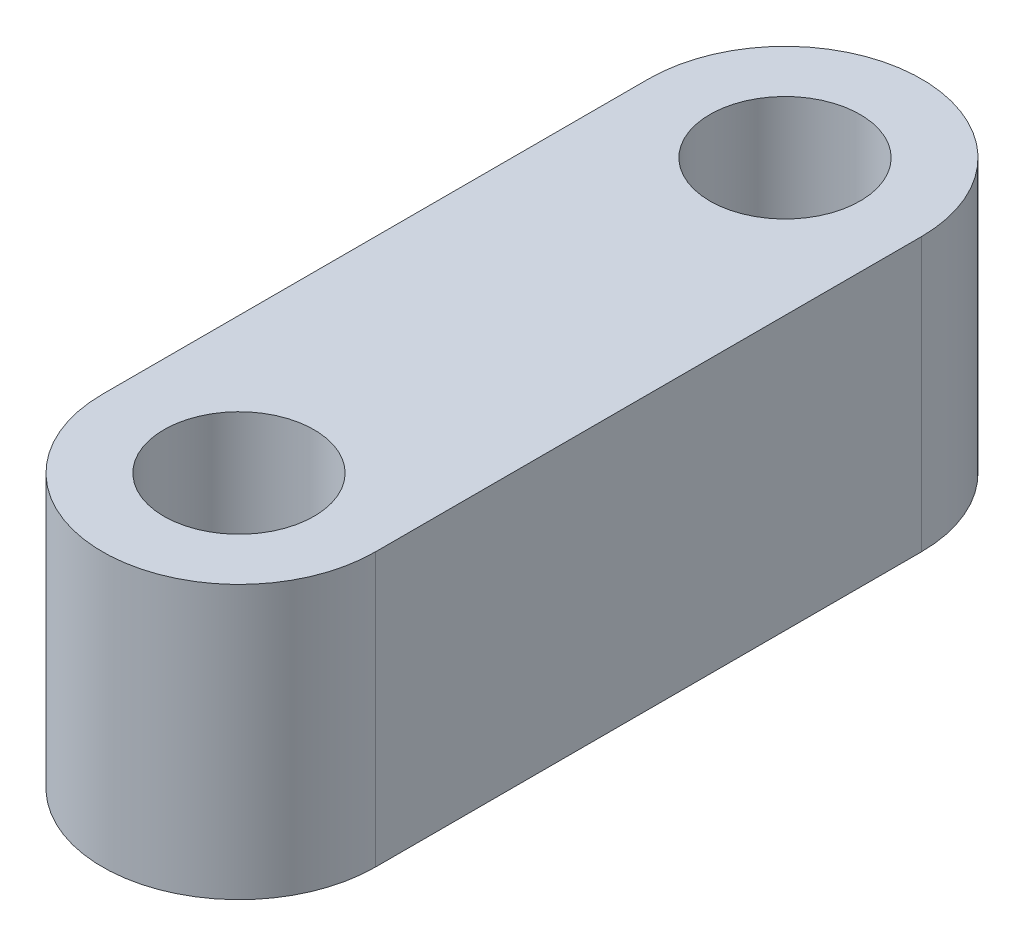
ISO-10303-21;
HEADER;
FILE_DESCRIPTION(('STEP AP214'),'2;1');
FILE_NAME('part.step','',(''),(''),'','','');
FILE_SCHEMA(('AUTOMOTIVE_DESIGN { 1 0 10303 214 1 1 1 1 }'));
ENDSEC;
DATA;
#1=APPLICATION_CONTEXT('core data for automotive mechanical design processes');
#2=APPLICATION_PROTOCOL_DEFINITION('international standard','automotive_design',2000,#1);
#3=PRODUCT_CONTEXT('',#1,'mechanical');
#4=PRODUCT('Part','Part','',(#3));
#5=PRODUCT_RELATED_PRODUCT_CATEGORY('part','',(#4));
#6=PRODUCT_DEFINITION_FORMATION('','',#4);
#7=PRODUCT_DEFINITION_CONTEXT('part definition',#1,'design');
#8=PRODUCT_DEFINITION('design','',#6,#7);
#9=PRODUCT_DEFINITION_SHAPE('','',#8);
#10=(LENGTH_UNIT() NAMED_UNIT(*) SI_UNIT(.MILLI.,.METRE.));
#11=(NAMED_UNIT(*) PLANE_ANGLE_UNIT() SI_UNIT($,.RADIAN.));
#12=(NAMED_UNIT(*) SI_UNIT($,.STERADIAN.) SOLID_ANGLE_UNIT());
#13=UNCERTAINTY_MEASURE_WITH_UNIT(LENGTH_MEASURE(1.E-05),#10,'distance_accuracy_value','');
#14=(GEOMETRIC_REPRESENTATION_CONTEXT(3) GLOBAL_UNCERTAINTY_ASSIGNED_CONTEXT((#13)) GLOBAL_UNIT_ASSIGNED_CONTEXT((#10,
#11,#12)) REPRESENTATION_CONTEXT('',''));
#15=CARTESIAN_POINT('',(0.,0.,0.));
#16=DIRECTION('',(0.,0.,1.));
#17=DIRECTION('',(1.,0.,0.));
#18=AXIS2_PLACEMENT_3D('',#15,#16,#17);
#19=CARTESIAN_POINT('',(-5.,10.,0.));
#20=DIRECTION('',(1.,0.,0.));
#21=DIRECTION('',(0.,0.,-1.));
#22=AXIS2_PLACEMENT_3D('',#19,#20,#21);
#23=PLANE('',#22);
#24=DIRECTION('',(0.,0.,1.));
#25=VECTOR('',#24,1.);
#26=CARTESIAN_POINT('',(-5.,0.,0.));
#27=LINE('',#26,#25);
#28=CARTESIAN_POINT('',(-5.,0.,-20.));
#29=VERTEX_POINT('',#28);
#30=CARTESIAN_POINT('',(-5.,0.,0.));
#31=VERTEX_POINT('',#30);
#32=EDGE_CURVE('E102',#29,#31,#27,.T.);
#33=ORIENTED_EDGE('',*,*,#32,.T.);
#34=DIRECTION('',(0.,-1.,0.));
#35=VECTOR('',#34,1.);
#36=CARTESIAN_POINT('',(-5.,10.,0.));
#37=LINE('',#36,#35);
#38=CARTESIAN_POINT('',(-5.,10.,0.));
#39=VERTEX_POINT('',#38);
#40=EDGE_CURVE('E11',#39,#31,#37,.T.);
#41=ORIENTED_EDGE('',*,*,#40,.F.);
#42=DIRECTION('',(0.,0.,1.));
#43=VECTOR('',#42,1.);
#44=CARTESIAN_POINT('',(-5.,10.,0.));
#45=LINE('',#44,#43);
#46=CARTESIAN_POINT('',(-5.,10.,-20.));
#47=VERTEX_POINT('',#46);
#48=EDGE_CURVE('E81',#47,#39,#45,.T.);
#49=ORIENTED_EDGE('',*,*,#48,.F.);
#50=DIRECTION('',(0.,-1.,0.));
#51=VECTOR('',#50,1.);
#52=CARTESIAN_POINT('',(-5.,10.,-20.));
#53=LINE('',#52,#51);
#54=EDGE_CURVE('E101',#47,#29,#53,.T.);
#55=ORIENTED_EDGE('',*,*,#54,.T.);
#56=EDGE_LOOP('',(#33,#41,#49,#55));
#57=FACE_BOUND('',#56,.T.);
#58=ADVANCED_FACE('F33',(#57),#23,.F.);
#59=CARTESIAN_POINT('',(0.,10.,0.));
#60=DIRECTION('',(0.,-1.,0.));
#61=DIRECTION('',(0.,0.,-1.));
#62=AXIS2_PLACEMENT_3D('',#59,#60,#61);
#63=CYLINDRICAL_SURFACE('',#62,5.);
#64=CARTESIAN_POINT('',(0.,0.,0.));
#65=DIRECTION('',(0.,1.,0.));
#66=DIRECTION('',(0.,0.,1.));
#67=AXIS2_PLACEMENT_3D('',#64,#65,#66);
#68=CIRCLE('',#67,5.);
#69=CARTESIAN_POINT('',(5.,0.,0.));
#70=VERTEX_POINT('',#69);
#71=EDGE_CURVE('E86',#31,#70,#68,.T.);
#72=ORIENTED_EDGE('',*,*,#71,.T.);
#73=DIRECTION('',(0.,-1.,0.));
#74=VECTOR('',#73,1.);
#75=CARTESIAN_POINT('',(5.,10.,0.));
#76=LINE('',#75,#74);
#77=CARTESIAN_POINT('',(5.,10.,0.));
#78=VERTEX_POINT('',#77);
#79=EDGE_CURVE('E41',#78,#70,#76,.T.);
#80=ORIENTED_EDGE('',*,*,#79,.F.);
#81=CARTESIAN_POINT('',(0.,10.,0.));
#82=DIRECTION('',(0.,1.,0.));
#83=DIRECTION('',(0.,0.,1.));
#84=AXIS2_PLACEMENT_3D('',#81,#82,#83);
#85=CIRCLE('',#84,5.);
#86=EDGE_CURVE('E75',#39,#78,#85,.T.);
#87=ORIENTED_EDGE('',*,*,#86,.F.);
#88=ORIENTED_EDGE('',*,*,#40,.T.);
#89=EDGE_LOOP('',(#72,#80,#87,#88));
#90=FACE_BOUND('',#89,.T.);
#91=ADVANCED_FACE('F85',(#90),#63,.T.);
#92=CARTESIAN_POINT('',(5.,10.,0.));
#93=DIRECTION('',(1.,0.,0.));
#94=DIRECTION('',(0.,0.,-1.));
#95=AXIS2_PLACEMENT_3D('',#92,#93,#94);
#96=PLANE('',#95);
#97=DIRECTION('',(0.,0.,1.));
#98=VECTOR('',#97,1.);
#99=CARTESIAN_POINT('',(5.,0.,0.));
#100=LINE('',#99,#98);
#101=CARTESIAN_POINT('',(5.,0.,-20.));
#102=VERTEX_POINT('',#101);
#103=EDGE_CURVE('E106',#102,#70,#100,.T.);
#104=ORIENTED_EDGE('',*,*,#103,.F.);
#105=DIRECTION('',(0.,-1.,0.));
#106=VECTOR('',#105,1.);
#107=CARTESIAN_POINT('',(5.,10.,-20.));
#108=LINE('',#107,#106);
#109=CARTESIAN_POINT('',(5.,10.,-20.));
#110=VERTEX_POINT('',#109);
#111=EDGE_CURVE('E65',#110,#102,#108,.T.);
#112=ORIENTED_EDGE('',*,*,#111,.F.);
#113=DIRECTION('',(0.,0.,1.));
#114=VECTOR('',#113,1.);
#115=CARTESIAN_POINT('',(5.,10.,0.));
#116=LINE('',#115,#114);
#117=EDGE_CURVE('E79',#110,#78,#116,.T.);
#118=ORIENTED_EDGE('',*,*,#117,.T.);
#119=ORIENTED_EDGE('',*,*,#79,.T.);
#120=EDGE_LOOP('',(#104,#112,#118,#119));
#121=FACE_BOUND('',#120,.T.);
#122=ADVANCED_FACE('F90',(#121),#96,.T.);
#123=CARTESIAN_POINT('',(0.,10.,-20.));
#124=DIRECTION('',(0.,-1.,0.));
#125=DIRECTION('',(0.,0.,-1.));
#126=AXIS2_PLACEMENT_3D('',#123,#124,#125);
#127=CYLINDRICAL_SURFACE('',#126,2.75);
#128=CARTESIAN_POINT('',(0.,10.,-20.));
#129=DIRECTION('',(0.,1.,0.));
#130=DIRECTION('',(0.,0.,1.));
#131=AXIS2_PLACEMENT_3D('',#128,#129,#130);
#132=CIRCLE('',#131,2.75);
#133=CARTESIAN_POINT('',(0.,10.,-17.25));
#134=VERTEX_POINT('',#133);
#135=EDGE_CURVE('E92',#134,#134,#132,.T.);
#136=ORIENTED_EDGE('',*,*,#135,.T.);
#137=EDGE_LOOP('',(#136));
#138=FACE_BOUND('',#137,.T.);
#139=CARTESIAN_POINT('',(0.,0.,-20.));
#140=DIRECTION('',(0.,1.,0.));
#141=DIRECTION('',(0.,0.,1.));
#142=AXIS2_PLACEMENT_3D('',#139,#140,#141);
#143=CIRCLE('',#142,2.75);
#144=CARTESIAN_POINT('',(0.,0.,-17.25));
#145=VERTEX_POINT('',#144);
#146=EDGE_CURVE('E109',#145,#145,#143,.T.);
#147=ORIENTED_EDGE('',*,*,#146,.F.);
#148=EDGE_LOOP('',(#147));
#149=FACE_BOUND('',#148,.T.);
#150=ADVANCED_FACE('F137',(#138,#149),#127,.F.);
#151=CARTESIAN_POINT('',(0.,10.,-20.));
#152=DIRECTION('',(0.,-1.,0.));
#153=DIRECTION('',(0.,0.,-1.));
#154=AXIS2_PLACEMENT_3D('',#151,#152,#153);
#155=CYLINDRICAL_SURFACE('',#154,5.);
#156=CARTESIAN_POINT('',(0.,0.,-20.));
#157=DIRECTION('',(0.,1.,0.));
#158=DIRECTION('',(0.,0.,1.));
#159=AXIS2_PLACEMENT_3D('',#156,#157,#158);
#160=CIRCLE('',#159,5.);
#161=EDGE_CURVE('E68',#102,#29,#160,.T.);
#162=ORIENTED_EDGE('',*,*,#161,.T.);
#163=ORIENTED_EDGE('',*,*,#54,.F.);
#164=CARTESIAN_POINT('',(0.,10.,-20.));
#165=DIRECTION('',(0.,1.,0.));
#166=DIRECTION('',(0.,0.,1.));
#167=AXIS2_PLACEMENT_3D('',#164,#165,#166);
#168=CIRCLE('',#167,5.);
#169=EDGE_CURVE('E49',#110,#47,#168,.T.);
#170=ORIENTED_EDGE('',*,*,#169,.F.);
#171=ORIENTED_EDGE('',*,*,#111,.T.);
#172=EDGE_LOOP('',(#162,#163,#170,#171));
#173=FACE_BOUND('',#172,.T.);
#174=ADVANCED_FACE('F129',(#173),#155,.T.);
#175=CARTESIAN_POINT('',(0.,10.,0.));
#176=DIRECTION('',(0.,-1.,0.));
#177=DIRECTION('',(0.,0.,-1.));
#178=AXIS2_PLACEMENT_3D('',#175,#176,#177);
#179=CYLINDRICAL_SURFACE('',#178,2.75);
#180=CARTESIAN_POINT('',(0.,10.,0.));
#181=DIRECTION('',(0.,1.,0.));
#182=DIRECTION('',(0.,0.,1.));
#183=AXIS2_PLACEMENT_3D('',#180,#181,#182);
#184=CIRCLE('',#183,2.75);
#185=CARTESIAN_POINT('',(0.,10.,2.75));
#186=VERTEX_POINT('',#185);
#187=EDGE_CURVE('E98',#186,#186,#184,.T.);
#188=ORIENTED_EDGE('',*,*,#187,.T.);
#189=EDGE_LOOP('',(#188));
#190=FACE_BOUND('',#189,.T.);
#191=CARTESIAN_POINT('',(0.,0.,0.));
#192=DIRECTION('',(0.,1.,0.));
#193=DIRECTION('',(0.,0.,1.));
#194=AXIS2_PLACEMENT_3D('',#191,#192,#193);
#195=CIRCLE('',#194,2.75);
#196=CARTESIAN_POINT('',(0.,0.,2.75));
#197=VERTEX_POINT('',#196);
#198=EDGE_CURVE('E112',#197,#197,#195,.T.);
#199=ORIENTED_EDGE('',*,*,#198,.F.);
#200=EDGE_LOOP('',(#199));
#201=FACE_BOUND('',#200,.T.);
#202=ADVANCED_FACE('F127',(#190,#201),#179,.F.);
#203=CARTESIAN_POINT('',(0.,10.,0.));
#204=DIRECTION('',(0.,1.,0.));
#205=DIRECTION('',(0.,0.,1.));
#206=AXIS2_PLACEMENT_3D('',#203,#204,#205);
#207=PLANE('',#206);
#208=ORIENTED_EDGE('',*,*,#48,.T.);
#209=ORIENTED_EDGE('',*,*,#86,.T.);
#210=ORIENTED_EDGE('',*,*,#117,.F.);
#211=ORIENTED_EDGE('',*,*,#169,.T.);
#212=EDGE_LOOP('',(#208,#209,#210,#211));
#213=FACE_BOUND('',#212,.T.);
#214=ORIENTED_EDGE('',*,*,#135,.F.);
#215=EDGE_LOOP('',(#214));
#216=FACE_BOUND('',#215,.T.);
#217=ORIENTED_EDGE('',*,*,#187,.F.);
#218=EDGE_LOOP('',(#217));
#219=FACE_BOUND('',#218,.T.);
#220=ADVANCED_FACE('F76',(#213,#216,#219),#207,.T.);
#221=CARTESIAN_POINT('',(0.,0.,0.));
#222=DIRECTION('',(0.,1.,0.));
#223=DIRECTION('',(0.,0.,1.));
#224=AXIS2_PLACEMENT_3D('',#221,#222,#223);
#225=PLANE('',#224);
#226=ORIENTED_EDGE('',*,*,#32,.F.);
#227=ORIENTED_EDGE('',*,*,#161,.F.);
#228=ORIENTED_EDGE('',*,*,#103,.T.);
#229=ORIENTED_EDGE('',*,*,#71,.F.);
#230=EDGE_LOOP('',(#226,#227,#228,#229));
#231=FACE_BOUND('',#230,.T.);
#232=ORIENTED_EDGE('',*,*,#146,.T.);
#233=EDGE_LOOP('',(#232));
#234=FACE_BOUND('',#233,.T.);
#235=ORIENTED_EDGE('',*,*,#198,.T.);
#236=EDGE_LOOP('',(#235));
#237=FACE_BOUND('',#236,.T.);
#238=ADVANCED_FACE('F119',(#231,#234,#237),#225,.F.);
#239=CLOSED_SHELL('',(#58,#91,#122,#150,#174,#202,#220,#238));
#240=MANIFOLD_SOLID_BREP('B2',#239);
#241=ADVANCED_BREP_SHAPE_REPRESENTATION('',(#18,#240),#14);
#242=SHAPE_DEFINITION_REPRESENTATION(#9,#241);
ENDSEC;
END-ISO-10303-21;
